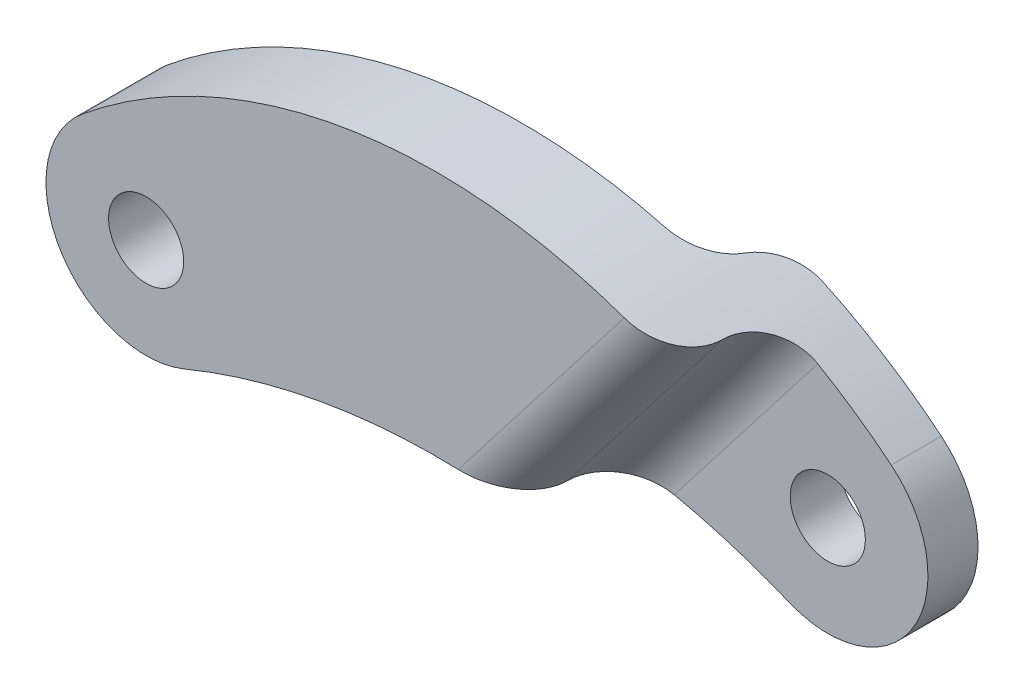
ISO-10303-21;
HEADER;
FILE_DESCRIPTION(('STEP AP214'),'2;1');
FILE_NAME('part.step','',(''),(''),'','','');
FILE_SCHEMA(('AUTOMOTIVE_DESIGN { 1 0 10303 214 1 1 1 1 }'));
ENDSEC;
DATA;
#1=APPLICATION_CONTEXT('core data for automotive mechanical design processes');
#2=APPLICATION_PROTOCOL_DEFINITION('international standard','automotive_design',2000,#1);
#3=PRODUCT_CONTEXT('',#1,'mechanical');
#4=PRODUCT('Part','Part','',(#3));
#5=PRODUCT_RELATED_PRODUCT_CATEGORY('part','',(#4));
#6=PRODUCT_DEFINITION_FORMATION('','',#4);
#7=PRODUCT_DEFINITION_CONTEXT('part definition',#1,'design');
#8=PRODUCT_DEFINITION('design','',#6,#7);
#9=PRODUCT_DEFINITION_SHAPE('','',#8);
#10=(LENGTH_UNIT() NAMED_UNIT(*) SI_UNIT(.MILLI.,.METRE.));
#11=(NAMED_UNIT(*) PLANE_ANGLE_UNIT() SI_UNIT($,.RADIAN.));
#12=(NAMED_UNIT(*) SI_UNIT($,.STERADIAN.) SOLID_ANGLE_UNIT());
#13=UNCERTAINTY_MEASURE_WITH_UNIT(LENGTH_MEASURE(1.E-05),#10,'distance_accuracy_value','');
#14=(GEOMETRIC_REPRESENTATION_CONTEXT(3) GLOBAL_UNCERTAINTY_ASSIGNED_CONTEXT((#13)) GLOBAL_UNIT_ASSIGNED_CONTEXT((#10,
#11,#12)) REPRESENTATION_CONTEXT('',''));
#15=CARTESIAN_POINT('',(0.,0.,0.));
#16=DIRECTION('',(0.,0.,1.));
#17=DIRECTION('',(1.,0.,0.));
#18=AXIS2_PLACEMENT_3D('',#15,#16,#17);
#19=CARTESIAN_POINT('',(0.,0.,0.5));
#20=DIRECTION('',(0.,0.,1.));
#21=DIRECTION('',(1.,0.,0.));
#22=AXIS2_PLACEMENT_3D('',#19,#20,#21);
#23=PLANE('',#22);
#24=CARTESIAN_POINT('',(5.80500000000001,-7.08580023417827,0.5));
#25=DIRECTION('',(0.,0.,1.));
#26=DIRECTION('',(-1.,0.,0.));
#27=AXIS2_PLACEMENT_3D('',#24,#25,#26);
#28=CIRCLE('',#27,11.1600540368865);
#29=CARTESIAN_POINT('',(12.8774597718799,1.54710882832013,0.5));
#30=VERTEX_POINT('',#29);
#31=CARTESIAN_POINT('',(11.409561525458,2.56488348323696,0.5));
#32=VERTEX_POINT('',#31);
#33=EDGE_CURVE('E142',#30,#32,#28,.T.);
#34=ORIENTED_EDGE('',*,*,#33,.T.);
#35=DIRECTION('',(0.612486689037816,0.790480901572893,0.));
#36=VECTOR('',#35,1.);
#37=CARTESIAN_POINT('',(5.88756775120085,-4.56185199571997,0.5));
#38=LINE('',#37,#36);
#39=CARTESIAN_POINT('',(8.54411179028973,-1.13329205364845,0.5));
#40=VERTEX_POINT('',#39);
#41=EDGE_CURVE('E58',#32,#40,#38,.F.);
#42=ORIENTED_EDGE('',*,*,#41,.T.);
#43=CARTESIAN_POINT('',(5.805,-14.0139650238523,0.5));
#44=DIRECTION('',(0.,0.,1.));
#45=DIRECTION('',(-1.,0.,0.));
#46=AXIS2_PLACEMENT_3D('',#43,#44,#45);
#47=CIRCLE('',#46,13.1686927811778);
#48=CARTESIAN_POINT('',(10.8446077432324,-1.8477485470919,0.5));
#49=VERTEX_POINT('',#48);
#50=EDGE_CURVE('E246',#49,#40,#47,.T.);
#51=ORIENTED_EDGE('',*,*,#50,.F.);
#52=CARTESIAN_POINT('',(11.61,0.,0.5));
#53=DIRECTION('',(0.,0.,1.));
#54=DIRECTION('',(1.,0.,0.));
#55=AXIS2_PLACEMENT_3D('',#52,#53,#54);
#56=CIRCLE('',#55,2.);
#57=EDGE_CURVE('E152',#49,#30,#56,.T.);
#58=ORIENTED_EDGE('',*,*,#57,.T.);
#59=EDGE_LOOP('',(#34,#42,#51,#58));
#60=FACE_BOUND('',#59,.T.);
#61=CARTESIAN_POINT('',(11.61,0.,0.5));
#62=DIRECTION('',(0.,0.,1.));
#63=DIRECTION('',(1.,0.,0.));
#64=AXIS2_PLACEMENT_3D('',#61,#62,#63);
#65=CIRCLE('',#64,0.750000000000002);
#66=CARTESIAN_POINT('',(12.36,0.,0.5));
#67=VERTEX_POINT('',#66);
#68=EDGE_CURVE('E146',#67,#67,#65,.T.);
#69=ORIENTED_EDGE('',*,*,#68,.F.);
#70=EDGE_LOOP('',(#69));
#71=FACE_BOUND('',#70,.T.);
#72=ADVANCED_FACE('F32',(#60,#71),#23,.T.);
#73=CARTESIAN_POINT('',(0.,0.,-0.5));
#74=DIRECTION('',(0.,0.,1.));
#75=DIRECTION('',(1.,0.,0.));
#76=AXIS2_PLACEMENT_3D('',#73,#74,#75);
#77=PLANE('',#76);
#78=CARTESIAN_POINT('',(5.805,-14.0139650238523,-0.5));
#79=DIRECTION('',(0.,0.,1.));
#80=DIRECTION('',(-1.,0.,0.));
#81=AXIS2_PLACEMENT_3D('',#78,#79,#80);
#82=CIRCLE('',#81,13.1686927811778);
#83=CARTESIAN_POINT('',(10.8446077432324,-1.8477485470919,-0.5));
#84=VERTEX_POINT('',#83);
#85=CARTESIAN_POINT('',(7.42474680096433,-0.945266164906543,-0.5));
#86=VERTEX_POINT('',#85);
#87=EDGE_CURVE('E235',#84,#86,#82,.T.);
#88=ORIENTED_EDGE('',*,*,#87,.T.);
#89=DIRECTION('',(0.612486689037816,0.790480901572893,0.));
#90=VECTOR('',#89,1.);
#91=CARTESIAN_POINT('',(5.09708684962795,-3.94936530668216,-0.5));
#92=LINE('',#91,#90);
#93=CARTESIAN_POINT('',(10.5085085495051,3.03466484559743,-0.5));
#94=VERTEX_POINT('',#93);
#95=EDGE_CURVE('E155',#86,#94,#92,.T.);
#96=ORIENTED_EDGE('',*,*,#95,.T.);
#97=CARTESIAN_POINT('',(5.80500000000001,-7.08580023417827,-0.5));
#98=DIRECTION('',(0.,0.,1.));
#99=DIRECTION('',(-1.,0.,0.));
#100=AXIS2_PLACEMENT_3D('',#97,#98,#99);
#101=CIRCLE('',#100,11.1600540368865);
#102=CARTESIAN_POINT('',(12.8774597718799,1.54710882832013,-0.5));
#103=VERTEX_POINT('',#102);
#104=EDGE_CURVE('E137',#103,#94,#101,.T.);
#105=ORIENTED_EDGE('',*,*,#104,.F.);
#106=CARTESIAN_POINT('',(11.61,0.,-0.5));
#107=DIRECTION('',(0.,0.,1.));
#108=DIRECTION('',(1.,0.,0.));
#109=AXIS2_PLACEMENT_3D('',#106,#107,#108);
#110=CIRCLE('',#109,2.);
#111=EDGE_CURVE('E149',#84,#103,#110,.T.);
#112=ORIENTED_EDGE('',*,*,#111,.F.);
#113=EDGE_LOOP('',(#88,#96,#105,#112));
#114=FACE_BOUND('',#113,.T.);
#115=CARTESIAN_POINT('',(11.61,0.,-0.5));
#116=DIRECTION('',(0.,0.,1.));
#117=DIRECTION('',(1.,0.,0.));
#118=AXIS2_PLACEMENT_3D('',#115,#116,#117);
#119=CIRCLE('',#118,0.750000000000002);
#120=CARTESIAN_POINT('',(12.36,0.,-0.5));
#121=VERTEX_POINT('',#120);
#122=EDGE_CURVE('E140',#121,#121,#119,.T.);
#123=ORIENTED_EDGE('',*,*,#122,.T.);
#124=EDGE_LOOP('',(#123));
#125=FACE_BOUND('',#124,.T.);
#126=ADVANCED_FACE('F241',(#114,#125),#77,.F.);
#127=CARTESIAN_POINT('',(0.,0.,0.5));
#128=DIRECTION('',(0.,0.,-1.));
#129=DIRECTION('',(-1.,0.,0.));
#130=AXIS2_PLACEMENT_3D('',#127,#128,#129);
#131=CYLINDRICAL_SURFACE('',#130,2.);
#132=DIRECTION('',(0.,0.,1.));
#133=VECTOR('',#132,1.);
#134=CARTESIAN_POINT('',(-1.26745977187993,1.54710882832013,-0.5));
#135=LINE('',#134,#133);
#136=CARTESIAN_POINT('',(-1.26745977187993,1.54710882832013,0.8));
#137=VERTEX_POINT('',#136);
#138=CARTESIAN_POINT('',(-1.26745977187993,1.54710882832013,2.5));
#139=VERTEX_POINT('',#138);
#140=EDGE_CURVE('E118',#137,#139,#135,.T.);
#141=ORIENTED_EDGE('',*,*,#140,.F.);
#142=CARTESIAN_POINT('',(0.,0.,0.8));
#143=DIRECTION('',(0.,0.,1.));
#144=DIRECTION('',(1.,0.,0.));
#145=AXIS2_PLACEMENT_3D('',#142,#143,#144);
#146=CIRCLE('',#145,2.);
#147=CARTESIAN_POINT('',(0.765392256767593,-1.8477485470919,0.8));
#148=VERTEX_POINT('',#147);
#149=EDGE_CURVE('E124',#137,#148,#146,.T.);
#150=ORIENTED_EDGE('',*,*,#149,.T.);
#151=DIRECTION('',(0.,0.,1.));
#152=VECTOR('',#151,1.);
#153=CARTESIAN_POINT('',(0.765392256767595,-1.8477485470919,-0.5));
#154=LINE('',#153,#152);
#155=CARTESIAN_POINT('',(0.765392256767593,-1.8477485470919,2.5));
#156=VERTEX_POINT('',#155);
#157=EDGE_CURVE('E250',#148,#156,#154,.T.);
#158=ORIENTED_EDGE('',*,*,#157,.T.);
#159=CARTESIAN_POINT('',(0.,0.,2.5));
#160=DIRECTION('',(0.,0.,1.));
#161=DIRECTION('',(1.,0.,0.));
#162=AXIS2_PLACEMENT_3D('',#159,#160,#161);
#163=CIRCLE('',#162,2.);
#164=EDGE_CURVE('E135',#139,#156,#163,.T.);
#165=ORIENTED_EDGE('',*,*,#164,.F.);
#166=EDGE_LOOP('',(#141,#150,#158,#165));
#167=FACE_BOUND('',#166,.T.);
#168=ADVANCED_FACE('F133',(#167),#131,.T.);
#169=CARTESIAN_POINT('',(11.61,0.,0.5));
#170=DIRECTION('',(0.,0.,-1.));
#171=DIRECTION('',(-1.,0.,0.));
#172=AXIS2_PLACEMENT_3D('',#169,#170,#171);
#173=CYLINDRICAL_SURFACE('',#172,2.);
#174=ORIENTED_EDGE('',*,*,#111,.T.);
#175=DIRECTION('',(0.,0.,1.));
#176=VECTOR('',#175,1.);
#177=CARTESIAN_POINT('',(12.8774597718799,1.54710882832013,-0.5));
#178=LINE('',#177,#176);
#179=EDGE_CURVE('E136',#103,#30,#178,.T.);
#180=ORIENTED_EDGE('',*,*,#179,.T.);
#181=ORIENTED_EDGE('',*,*,#57,.F.);
#182=DIRECTION('',(0.,0.,1.));
#183=VECTOR('',#182,1.);
#184=CARTESIAN_POINT('',(10.8446077432324,-1.8477485470919,-0.5));
#185=LINE('',#184,#183);
#186=EDGE_CURVE('E245',#84,#49,#185,.T.);
#187=ORIENTED_EDGE('',*,*,#186,.F.);
#188=EDGE_LOOP('',(#174,#180,#181,#187));
#189=FACE_BOUND('',#188,.T.);
#190=ADVANCED_FACE('F249',(#189),#173,.T.);
#191=CARTESIAN_POINT('',(0.,0.,0.5));
#192=DIRECTION('',(0.,0.,-1.));
#193=DIRECTION('',(-1.,0.,0.));
#194=AXIS2_PLACEMENT_3D('',#191,#192,#193);
#195=CYLINDRICAL_SURFACE('',#194,0.75);
#196=CARTESIAN_POINT('',(0.,0.,0.8));
#197=DIRECTION('',(0.,0.,1.));
#198=DIRECTION('',(1.,0.,0.));
#199=AXIS2_PLACEMENT_3D('',#196,#197,#198);
#200=CIRCLE('',#199,0.75);
#201=CARTESIAN_POINT('',(0.75,0.,0.8));
#202=VERTEX_POINT('',#201);
#203=EDGE_CURVE('E266',#202,#202,#200,.T.);
#204=ORIENTED_EDGE('',*,*,#203,.F.);
#205=EDGE_LOOP('',(#204));
#206=FACE_BOUND('',#205,.T.);
#207=CARTESIAN_POINT('',(0.,0.,2.5));
#208=DIRECTION('',(0.,0.,1.));
#209=DIRECTION('',(1.,0.,0.));
#210=AXIS2_PLACEMENT_3D('',#207,#208,#209);
#211=CIRCLE('',#210,0.75);
#212=CARTESIAN_POINT('',(0.75,0.,2.5));
#213=VERTEX_POINT('',#212);
#214=EDGE_CURVE('E261',#213,#213,#211,.T.);
#215=ORIENTED_EDGE('',*,*,#214,.T.);
#216=EDGE_LOOP('',(#215));
#217=FACE_BOUND('',#216,.T.);
#218=ADVANCED_FACE('F284',(#206,#217),#195,.F.);
#219=CARTESIAN_POINT('',(11.61,0.,0.5));
#220=DIRECTION('',(0.,0.,-1.));
#221=DIRECTION('',(-1.,0.,0.));
#222=AXIS2_PLACEMENT_3D('',#219,#220,#221);
#223=CYLINDRICAL_SURFACE('',#222,0.750000000000002);
#224=ORIENTED_EDGE('',*,*,#68,.T.);
#225=EDGE_LOOP('',(#224));
#226=FACE_BOUND('',#225,.T.);
#227=ORIENTED_EDGE('',*,*,#122,.F.);
#228=EDGE_LOOP('',(#227));
#229=FACE_BOUND('',#228,.T.);
#230=ADVANCED_FACE('F303',(#226,#229),#223,.F.);
#231=CARTESIAN_POINT('',(5.80500000000001,-7.08580023417827,-0.5));
#232=DIRECTION('',(0.,0.,1.));
#233=DIRECTION('',(1.,0.,0.));
#234=AXIS2_PLACEMENT_3D('',#231,#232,#233);
#235=CYLINDRICAL_SURFACE('',#234,11.1600540368865);
#236=ORIENTED_EDGE('',*,*,#104,.T.);
#237=CARTESIAN_POINT('',(10.5085085495051,3.03466484559743,-0.5));
#238=CARTESIAN_POINT('',(10.4545997913314,3.05973895002356,-0.500038307200525));
#239=CARTESIAN_POINT('',(10.4004991351627,3.08433910603536,-0.494961999885077));
#240=CARTESIAN_POINT('',(10.2934827304667,3.13201024938711,-0.474986815324863));
#241=CARTESIAN_POINT('',(10.2405663411904,3.15508207755746,-0.460093389332842));
#242=CARTESIAN_POINT('',(10.1374120896524,3.19914943907394,-0.420885271336029));
#243=CARTESIAN_POINT('',(10.0871748457609,3.22014449403035,-0.396568414935799));
#244=CARTESIAN_POINT('',(9.99090245106407,3.25962039999629,-0.33916165681637));
#245=CARTESIAN_POINT('',(9.94486686555581,3.27810151119532,-0.306072664047405));
#246=CARTESIAN_POINT('',(9.85852226097701,3.31217652495307,-0.231988760963064));
#247=CARTESIAN_POINT('',(9.81820664943204,3.3277737576782,-0.191003082518444));
#248=CARTESIAN_POINT('',(9.74466284481199,3.35581916156376,-0.102143245266141));
#249=CARTESIAN_POINT('',(9.71143499904493,3.36826717841484,-0.0542687490914888));
#250=CARTESIAN_POINT('',(9.65429153012761,3.38944029916484,0.0454597621794512));
#251=CARTESIAN_POINT('',(9.63012023971885,3.39826841148349,0.0971454374043927));
#252=CARTESIAN_POINT('',(9.59071155312003,3.41256338698437,0.204223596234319));
#253=CARTESIAN_POINT('',(9.57546274942595,3.41803454251251,0.259611245370437));
#254=CARTESIAN_POINT('',(9.55938610441248,3.42378701122959,0.346264680392394));
#255=CARTESIAN_POINT('',(9.5551505994438,3.42529822380831,0.376857090287763));
#256=CARTESIAN_POINT('',(9.54949872009529,3.4273124958907,0.438294114106932));
#257=CARTESIAN_POINT('',(9.54807871887972,3.4278168523977,0.469138352108181));
#258=CARTESIAN_POINT('',(9.54808119356653,3.42781709215597,0.5));
#259=B_SPLINE_CURVE_WITH_KNOTS('',3,(#237,#238,#239,#240,#241,#242,#243,#244,#245,#246,#247,
#248,#249,#250,#251,#252,#253,#254,#255,#256,#257,#258),.UNSPECIFIED.,.F.,.F.,(4,2,2,2,2,2,2,2,
2,2,4),(0.,0.178110237207162,0.356121656526966,0.534173986179928,0.712207873632867,
0.890034874192797,1.06787058646342,1.24021984957285,1.41234827791813,1.50498191224225,
1.59749614135646),.UNSPECIFIED.);
#260=CARTESIAN_POINT('',(9.61066818006019,3.40532438663833,0.150000000000001));
#261=VERTEX_POINT('',#260);
#262=EDGE_CURVE('E167',#94,#261,#259,.T.);
#263=ORIENTED_EDGE('',*,*,#262,.T.);
#264=CARTESIAN_POINT('',(9.61066818006019,3.40532438663833,0.15));
#265=CARTESIAN_POINT('',(9.60104391336495,3.40881513212217,0.176085519654819));
#266=CARTESIAN_POINT('',(9.59035270948725,3.41267886889881,0.201711384994293));
#267=CARTESIAN_POINT('',(9.56692228490636,3.42109770255776,0.251883180060699));
#268=CARTESIAN_POINT('',(9.55418357356539,3.4256526274762,0.276429376449546));
#269=CARTESIAN_POINT('',(9.51311083071071,3.4402418270236,0.348062977268186));
#270=CARTESIAN_POINT('',(9.48185314641106,3.45122516300105,0.393325980241011));
#271=CARTESIAN_POINT('',(9.4125827096049,3.47514153822328,0.477657776101736));
#272=CARTESIAN_POINT('',(9.37457331896887,3.4880736066538,0.516729633505074));
#273=CARTESIAN_POINT('',(9.29289466341916,3.51529629407549,0.587873425484103));
#274=CARTESIAN_POINT('',(9.24922349954141,3.529587368448,0.619943001757442));
#275=CARTESIAN_POINT('',(9.15586292799793,3.55943368433884,0.677444969317043));
#276=CARTESIAN_POINT('',(9.1060176386546,3.57501555106899,0.702609523057617));
#277=CARTESIAN_POINT('',(9.00292882872925,3.60639124509719,0.744433990444252));
#278=CARTESIAN_POINT('',(8.94968442431669,3.6221851266729,0.761091681938328));
#279=CARTESIAN_POINT('',(8.85635965322597,3.64908058369192,0.782322576424806));
#280=CARTESIAN_POINT('',(8.81675765428668,3.66026027275357,0.788971798337664));
#281=CARTESIAN_POINT('',(8.73707083994223,3.68227710299579,0.797806425010267));
#282=CARTESIAN_POINT('',(8.69698747212269,3.69311502773634,0.800002902382102));
#283=CARTESIAN_POINT('',(8.65683845296873,3.70372355255096,0.8));
#284=B_SPLINE_CURVE_WITH_KNOTS('',3,(#264,#265,#266,#267,#268,#269,#270,#271,#272,#273,#274,
#275,#276,#277,#278,#279,#280,#281,#282,#283),.UNSPECIFIED.,.F.,.F.,(4,2,2,2,2,2,2,2,2,4),(0.,
0.084012468830498,0.168004069980026,0.335412368609916,0.502737542267542,0.670118982841301,
0.843288013287649,1.01650225562468,1.14132138333945,1.26582974147891),.UNSPECIFIED.);
#285=CARTESIAN_POINT('',(8.65683845296873,3.70372355255096,0.8));
#286=VERTEX_POINT('',#285);
#287=EDGE_CURVE('E121',#261,#286,#284,.T.);
#288=ORIENTED_EDGE('',*,*,#287,.T.);
#289=CARTESIAN_POINT('',(5.80500000000001,-7.08580023417827,0.8));
#290=DIRECTION('',(0.,0.,1.));
#291=DIRECTION('',(1.,0.,0.));
#292=AXIS2_PLACEMENT_3D('',#289,#290,#291);
#293=CIRCLE('',#292,11.1600540368865);
#294=EDGE_CURVE('E112',#286,#137,#293,.T.);
#295=ORIENTED_EDGE('',*,*,#294,.T.);
#296=ORIENTED_EDGE('',*,*,#140,.T.);
#297=CARTESIAN_POINT('',(5.80500000000001,-7.08580023417827,2.5));
#298=DIRECTION('',(0.,0.,1.));
#299=DIRECTION('',(1.,0.,0.));
#300=AXIS2_PLACEMENT_3D('',#297,#298,#299);
#301=CIRCLE('',#300,11.1600540368865);
#302=CARTESIAN_POINT('',(9.54808119356654,3.42781709215597,2.5));
#303=VERTEX_POINT('',#302);
#304=EDGE_CURVE('E260',#303,#139,#301,.T.);
#305=ORIENTED_EDGE('',*,*,#304,.F.);
#306=CARTESIAN_POINT('',(9.54808119356654,3.42781709215597,2.5));
#307=CARTESIAN_POINT('',(9.60479113928533,3.40764729536137,2.50004466491557));
#308=CARTESIAN_POINT('',(9.66134807675275,3.38697524235907,2.49509619546598));
#309=CARTESIAN_POINT('',(9.7726530375485,3.34530504808339,2.47534028925758));
#310=CARTESIAN_POINT('',(9.82739914336134,3.3243065937048,2.46052273200392));
#311=CARTESIAN_POINT('',(9.93353735035689,3.28267467020534,2.4211264560919));
#312=CARTESIAN_POINT('',(9.9849242198029,3.26204180524963,2.39653291493059));
#313=CARTESIAN_POINT('',(10.082654603678,3.22202486408923,2.33812752979995));
#314=CARTESIAN_POINT('',(10.1290022964875,3.20263975879507,2.3043234058774));
#315=CARTESIAN_POINT('',(10.2138251008774,3.16657163373209,2.22959565288845));
#316=CARTESIAN_POINT('',(10.2525076857137,3.14982110291029,2.18894020604948));
#317=CARTESIAN_POINT('',(10.3226578803333,3.11905373631276,2.10089282178147));
#318=CARTESIAN_POINT('',(10.3541241778452,3.10503739781499,2.05349966164348));
#319=CARTESIAN_POINT('',(10.4079111552897,3.08085398540459,1.95511546541881));
#320=CARTESIAN_POINT('',(10.430508724499,3.07057128319713,1.90430380427422));
#321=CARTESIAN_POINT('',(10.4673865561996,3.05369545668609,1.79919538324296));
#322=CARTESIAN_POINT('',(10.4816749731903,3.04709871527602,1.74490209849027));
#323=CARTESIAN_POINT('',(10.4972319321875,3.03989982669158,1.65846142834048));
#324=CARTESIAN_POINT('',(10.5014596976246,3.03793860201241,1.62692543100499));
#325=CARTESIAN_POINT('',(10.5070963360006,3.0353212397165,1.56359799644812));
#326=CARTESIAN_POINT('',(10.5085095460513,3.03466309411866,1.53180702815453));
#327=CARTESIAN_POINT('',(10.5085085495051,3.03466484559743,1.5));
#328=B_SPLINE_CURVE_WITH_KNOTS('',3,(#306,#307,#308,#309,#310,#311,#312,#313,#314,#315,#316,
#317,#318,#319,#320,#321,#322,#323,#324,#325,#326,#327),.UNSPECIFIED.,.F.,.F.,(4,2,2,2,2,2,2,2,
2,2,4),(0.,0.180402825065742,0.360990933993724,0.541853904341653,0.722565744398397,
0.897383264136049,1.07223254901905,1.24107913791347,1.40975974198445,1.50525834491122,
1.60060967427656),.UNSPECIFIED.);
#329=CARTESIAN_POINT('',(10.5085085495051,3.03466484559743,1.5));
#330=VERTEX_POINT('',#329);
#331=EDGE_CURVE('E160',#303,#330,#328,.T.);
#332=ORIENTED_EDGE('',*,*,#331,.T.);
#333=CARTESIAN_POINT('',(10.5085085495051,3.03466484559743,1.5));
#334=CARTESIAN_POINT('',(10.5085079821643,3.03466443992367,1.47231611605151));
#335=CARTESIAN_POINT('',(10.509578539391,3.0341676381714,1.44464574662319));
#336=CARTESIAN_POINT('',(10.5138445706943,3.03218361238759,1.3895082622763));
#337=CARTESIAN_POINT('',(10.5170397974425,3.03069650363563,1.36204112407624));
#338=CARTESIAN_POINT('',(10.5297657242431,3.02476295467184,1.28033488413742));
#339=CARTESIAN_POINT('',(10.5424368653114,3.01884425450083,1.22665150853327));
#340=CARTESIAN_POINT('',(10.5756898838789,3.00318670254221,1.12240899322599));
#341=CARTESIAN_POINT('',(10.5962729563652,2.99344727368213,1.07185032680633));
#342=CARTESIAN_POINT('',(10.6446233606778,2.97032065843732,0.975193292122565));
#343=CARTESIAN_POINT('',(10.6723913485879,2.95693313892467,0.929095331712096));
#344=CARTESIAN_POINT('',(10.7345968263325,2.92654672762075,0.841995767513028));
#345=CARTESIAN_POINT('',(10.7691175658354,2.90950247062166,0.801069521491699));
#346=CARTESIAN_POINT('',(10.8434925496988,2.8722179701158,0.72608035945098));
#347=CARTESIAN_POINT('',(10.8833482000331,2.85197688385599,0.692019258636275));
#348=CARTESIAN_POINT('',(10.9680629441004,2.80823353494426,0.631009018741774));
#349=CARTESIAN_POINT('',(11.013009337538,2.78467185600187,0.604223748718969));
#350=CARTESIAN_POINT('',(11.1058430609583,2.73512797388139,0.559465265795672));
#351=CARTESIAN_POINT('',(11.1537288651537,2.70914702293657,0.54148752389495));
#352=CARTESIAN_POINT('',(11.2364880243384,2.66341844787549,0.518827086077654));
#353=CARTESIAN_POINT('',(11.2709822205243,2.64412313661005,0.511778229823213));
#354=CARTESIAN_POINT('',(11.3402033737145,2.60491335431612,0.502364024312786));
#355=CARTESIAN_POINT('',(11.374930020999,2.58499961323456,0.49999335185671));
#356=CARTESIAN_POINT('',(11.409561525458,2.56488348323696,0.5));
#357=B_SPLINE_CURVE_WITH_KNOTS('',3,(#333,#334,#335,#336,#337,#338,#339,#340,#341,#342,#343,
#344,#345,#346,#347,#348,#349,#350,#351,#352,#353,#354,#355,#356),.UNSPECIFIED.,.F.,.F.,(4,2,2,
2,2,2,2,2,2,2,2,4),(0.,0.0829998028282258,0.165989945510503,0.331557292873975,0.497149656712741,
0.662757146802546,0.830552065641355,0.998391292895606,1.16974525724486,1.34101101536481,
1.46119089358887,1.58123394279946),.UNSPECIFIED.);
#358=EDGE_CURVE('E45',#330,#32,#357,.T.);
#359=ORIENTED_EDGE('',*,*,#358,.T.);
#360=ORIENTED_EDGE('',*,*,#33,.F.);
#361=ORIENTED_EDGE('',*,*,#179,.F.);
#362=EDGE_LOOP('',(#236,#263,#288,#295,#296,#305,#332,#359,#360,#361));
#363=FACE_BOUND('',#362,.T.);
#364=ADVANCED_FACE('F115',(#363),#235,.T.);
#365=CARTESIAN_POINT('',(5.805,-14.0139650238523,-0.5));
#366=DIRECTION('',(0.,0.,1.));
#367=DIRECTION('',(1.,0.,0.));
#368=AXIS2_PLACEMENT_3D('',#365,#366,#367);
#369=CYLINDRICAL_SURFACE('',#368,13.1686927811778);
#370=CARTESIAN_POINT('',(5.805,-14.0139650238523,0.8));
#371=DIRECTION('',(0.,0.,-1.));
#372=DIRECTION('',(1.,0.,0.));
#373=AXIS2_PLACEMENT_3D('',#370,#371,#372);
#374=CIRCLE('',#373,13.1686927811778);
#375=CARTESIAN_POINT('',(5.11826569497717,-0.863190690781676,0.8));
#376=VERTEX_POINT('',#375);
#377=EDGE_CURVE('E129',#148,#376,#374,.T.);
#378=ORIENTED_EDGE('',*,*,#377,.T.);
#379=CARTESIAN_POINT('',(5.11826569497717,-0.863190690781675,0.8));
#380=CARTESIAN_POINT('',(5.20238558463027,-0.858764379613389,0.799978600577034));
#381=CARTESIAN_POINT('',(5.28678321401811,-0.855198922607742,0.793883882306117));
#382=CARTESIAN_POINT('',(5.45424425878165,-0.849684912269832,0.768586981098798));
#383=CARTESIAN_POINT('',(5.53729345530309,-0.847748340331775,0.749289532109288));
#384=CARTESIAN_POINT('',(5.6851020200592,-0.845645314134488,0.701089415848795));
#385=CARTESIAN_POINT('',(5.75056660901381,-0.845233469502223,0.674383698582748));
#386=CARTESIAN_POINT('',(5.87627450537823,-0.845316397214608,0.610824542320302));
#387=CARTESIAN_POINT('',(5.93653059276946,-0.845808880457441,0.573996925230744));
#388=CARTESIAN_POINT('',(6.03909415411996,-0.847271703873509,0.49771369078575));
#389=CARTESIAN_POINT('',(6.08267054453996,-0.848138464733629,0.459963482905231));
#390=CARTESIAN_POINT('',(6.16300065683459,-0.850078320888575,0.377840818718229));
#391=CARTESIAN_POINT('',(6.19976997654584,-0.851150932701799,0.333483933107323));
#392=CARTESIAN_POINT('',(6.24702990971045,-0.852684644722005,0.264664898481728));
#393=CARTESIAN_POINT('',(6.26093719822099,-0.853161080913181,0.242501801334194));
#394=CARTESIAN_POINT('',(6.28681006595921,-0.854083026958141,0.197060560697911));
#395=CARTESIAN_POINT('',(6.29877498544662,-0.854528526274704,0.173782041810381));
#396=CARTESIAN_POINT('',(6.30969091334131,-0.854946950795518,0.150000000000006));
#397=B_SPLINE_CURVE_WITH_KNOTS('',3,(#379,#380,#381,#382,#383,#384,#385,#386,#387,#388,#389,
#390,#391,#392,#393,#394,#395,#396),.UNSPECIFIED.,.F.,.F.,(4,2,2,2,2,2,2,2,4),(0.,
0.252866375070483,0.50757685563321,0.718886291703554,0.929661582814908,1.10198075129757,
1.27390004063179,1.35232561419748,1.43077777011687),.UNSPECIFIED.);
#398=CARTESIAN_POINT('',(6.30969091334127,-0.854946950795509,0.149999999999983));
#399=VERTEX_POINT('',#398);
#400=EDGE_CURVE('E206',#376,#399,#397,.T.);
#401=ORIENTED_EDGE('',*,*,#400,.T.);
#402=CARTESIAN_POINT('',(6.23181151562507,-0.852190770539255,0.5));
#403=CARTESIAN_POINT('',(6.23180845685173,-0.852191139241992,0.47549327650389));
#404=CARTESIAN_POINT('',(6.23292414107021,-0.85222680896996,0.451000265046908));
#405=CARTESIAN_POINT('',(6.23735328853625,-0.852371363605529,0.402226602135865));
#406=CARTESIAN_POINT('',(6.24066559867248,-0.852480210099648,0.377945846031133));
#407=CARTESIAN_POINT('',(6.25377956222271,-0.8529184727158,0.305990686468831));
#408=CARTESIAN_POINT('',(6.26675948069307,-0.853359552091774,0.258862979945064));
#409=CARTESIAN_POINT('',(6.30037592740979,-0.854582461997866,0.167582932130136));
#410=CARTESIAN_POINT('',(6.32099926779056,-0.855363706015664,0.12342561990423));
#411=CARTESIAN_POINT('',(6.3688519900811,-0.857327418155974,0.0388104738141371));
#412=CARTESIAN_POINT('',(6.3960905287614,-0.858510443337013,-0.00164212415932972));
#413=CARTESIAN_POINT('',(6.45831080829641,-0.861448411997837,-0.0811230408492553));
#414=CARTESIAN_POINT('',(6.49372293195729,-0.863239904316494,-0.119811075748784));
#415=CARTESIAN_POINT('',(6.56958606050184,-0.86743227802134,-0.191803098287842));
#416=CARTESIAN_POINT('',(6.61003821597006,-0.869833298686511,-0.225105852524277));
#417=CARTESIAN_POINT('',(6.70263701604407,-0.87580551439101,-0.291724667818891));
#418=CARTESIAN_POINT('',(6.75557088293445,-0.879510269683333,-0.323935105994872));
#419=CARTESIAN_POINT('',(6.86546508774972,-0.887924492729358,-0.380443053218253));
#420=CARTESIAN_POINT('',(6.92243018272212,-0.892635161188027,-0.404731017279623));
#421=CARTESIAN_POINT('',(7.05215416235254,-0.904268037398537,-0.449783070690396));
#422=CARTESIAN_POINT('',(7.12559320712157,-0.911449260857848,-0.468540075197545));
#423=CARTESIAN_POINT('',(7.27430827226854,-0.927278288118814,-0.493636073806774));
#424=CARTESIAN_POINT('',(7.3495817232013,-0.935924131325889,-0.499991528537834));
#425=CARTESIAN_POINT('',(7.42474680096433,-0.945266164906542,-0.5));
#426=B_SPLINE_CURVE_WITH_KNOTS('',3,(#402,#403,#404,#405,#406,#407,#408,#409,#410,#411,#412,
#413,#414,#415,#416,#417,#418,#419,#420,#421,#422,#423,#424,#425),.UNSPECIFIED.,.F.,.F.,(4,2,2,
2,2,2,2,2,2,2,2,4),(0.,0.0734684490759452,0.146898361634635,0.292751689510141,0.438354526604062,
0.584160067790014,0.741015688946585,0.897907184376364,1.08341666342107,1.26914882553572,
1.49647292242717,1.72349508530127),.UNSPECIFIED.);
#427=EDGE_CURVE('E190',#399,#86,#426,.T.);
#428=ORIENTED_EDGE('',*,*,#427,.T.);
#429=ORIENTED_EDGE('',*,*,#87,.F.);
#430=ORIENTED_EDGE('',*,*,#186,.T.);
#431=ORIENTED_EDGE('',*,*,#50,.T.);
#432=CARTESIAN_POINT('',(8.54411179028973,-1.13329205364845,0.5));
#433=CARTESIAN_POINT('',(8.47620645867082,-1.11883042336752,0.499991154604004));
#434=CARTESIAN_POINT('',(8.40819210493737,-1.10494910049924,0.505864592847744));
#435=CARTESIAN_POINT('',(8.273730489546,-1.07857190118771,0.529045048238693));
#436=CARTESIAN_POINT('',(8.20728631081606,-1.0660785966128,0.546372889815682));
#437=CARTESIAN_POINT('',(8.07797175088626,-1.04274960768125,0.59214280443788));
#438=CARTESIAN_POINT('',(8.01510360419864,-1.03191495274738,0.620591741064491));
#439=CARTESIAN_POINT('',(7.89507451139023,-1.01205183979277,0.688169427405429));
#440=CARTESIAN_POINT('',(7.83791071776311,-1.00302247832128,0.727292811843936));
#441=CARTESIAN_POINT('',(7.73368656140914,-0.987172855159449,0.81388034261669));
#442=CARTESIAN_POINT('',(7.68631856181271,-0.980280025767659,0.860958582686055));
#443=CARTESIAN_POINT('',(7.60137508682262,-0.96830095643697,0.963502861158073));
#444=CARTESIAN_POINT('',(7.5637931128776,-0.963213516784255,1.01896329436761));
#445=CARTESIAN_POINT('',(7.50485278017103,-0.95541434126254,1.1292323721004));
#446=CARTESIAN_POINT('',(7.48205360562619,-0.952485120371871,1.18325576179941));
#447=CARTESIAN_POINT('',(7.44738159915649,-0.948079424381282,1.29469045851749));
#448=CARTESIAN_POINT('',(7.43547590737595,-0.946598579361933,1.35209101712759));
#449=CARTESIAN_POINT('',(7.42786880123096,-0.945653499235207,1.42495656790778));
#450=CARTESIAN_POINT('',(7.42669812362994,-0.945508173429303,1.43995090588103));
#451=CARTESIAN_POINT('',(7.42513844435503,-0.945314652297461,1.46996101233869));
#452=CARTESIAN_POINT('',(7.42474841411406,-0.945266329162281,1.48497672650312));
#453=CARTESIAN_POINT('',(7.42474680096433,-0.945266164906538,1.5));
#454=B_SPLINE_CURVE_WITH_KNOTS('',3,(#432,#433,#434,#435,#436,#437,#438,#439,#440,#441,#442,
#443,#444,#445,#446,#447,#448,#449,#450,#451,#452,#453),.UNSPECIFIED.,.F.,.F.,(4,2,2,2,2,2,2,2,
2,2,4),(0.,0.208022654760259,0.416424544568668,0.624955256884633,0.833381348311818,
1.03365852341593,1.23380236043066,1.40892580740925,1.58351924143488,1.62862831323804,
1.6736779109015),.UNSPECIFIED.);
#455=CARTESIAN_POINT('',(7.42474680096433,-0.945266164906542,1.5));
#456=VERTEX_POINT('',#455);
#457=EDGE_CURVE('E11',#40,#456,#454,.T.);
#458=ORIENTED_EDGE('',*,*,#457,.T.);
#459=CARTESIAN_POINT('',(7.42474680096433,-0.945266164906542,1.5));
#460=CARTESIAN_POINT('',(7.42474824378731,-0.945266805260724,1.5251876114769));
#461=CARTESIAN_POINT('',(7.42364760094938,-0.945129883128837,1.55036213796094));
#462=CARTESIAN_POINT('',(7.41926783501788,-0.944587983045424,1.60051057315308));
#463=CARTESIAN_POINT('',(7.41598936885114,-0.944183085927016,1.62548454006029));
#464=CARTESIAN_POINT('',(7.40296791242617,-0.942582209871265,1.69962114137935));
#465=CARTESIAN_POINT('',(7.39003827036568,-0.940999900524855,1.74825137526711));
#466=CARTESIAN_POINT('',(7.35628758605538,-0.936952357713761,1.84256346119557));
#467=CARTESIAN_POINT('',(7.33547223004426,-0.934487760520435,1.88824741003447));
#468=CARTESIAN_POINT('',(7.28682787878807,-0.928887515436232,1.97569551630254));
#469=CARTESIAN_POINT('',(7.25899338327209,-0.925751341582929,2.01745656431781));
#470=CARTESIAN_POINT('',(7.19590447943489,-0.918893270451528,2.09811120771486));
#471=CARTESIAN_POINT('',(7.16036195753881,-0.915150719694756,2.1367765580781));
#472=CARTESIAN_POINT('',(7.08397796696187,-0.907472013976818,2.20838893250842));
#473=CARTESIAN_POINT('',(7.04313619660805,-0.903535848001549,2.24133563077714));
#474=CARTESIAN_POINT('',(6.95171261162994,-0.895204278481867,2.30518013871335));
#475=CARTESIAN_POINT('',(6.90055499967352,-0.890815811476065,2.33525260871471));
#476=CARTESIAN_POINT('',(6.79437103325472,-0.882382057794862,2.38777365229687));
#477=CARTESIAN_POINT('',(6.73933781510464,-0.878337409466836,2.41020826750891));
#478=CARTESIAN_POINT('',(6.61040895197262,-0.869725814924579,2.45295236657057));
#479=CARTESIAN_POINT('',(6.53567152918667,-0.865347561763234,2.47075877370386));
#480=CARTESIAN_POINT('',(6.38450619811651,-0.857805138771778,2.49426593823586));
#481=CARTESIAN_POINT('',(6.30808516338805,-0.854636751207356,2.50000907078756));
#482=CARTESIAN_POINT('',(6.23181151562507,-0.852190770539256,2.5));
#483=B_SPLINE_CURVE_WITH_KNOTS('',3,(#459,#460,#461,#462,#463,#464,#465,#466,#467,#468,#469,
#470,#471,#472,#473,#474,#475,#476,#477,#478,#479,#480,#481,#482),.UNSPECIFIED.,.F.,.F.,(4,2,2,
2,2,2,2,2,2,2,2,4),(0.,0.075512914475057,0.151003061287907,0.301235016897313,0.451358848653137,
0.601600686560247,0.75893094537527,0.916270164541143,1.09409584748994,1.27224478836875,
1.50205736322303,1.73106130675919),.UNSPECIFIED.);
#484=CARTESIAN_POINT('',(6.23181151562507,-0.852190770539253,2.5));
#485=VERTEX_POINT('',#484);
#486=EDGE_CURVE('E185',#456,#485,#483,.T.);
#487=ORIENTED_EDGE('',*,*,#486,.T.);
#488=CARTESIAN_POINT('',(5.805,-14.0139650238523,2.5));
#489=DIRECTION('',(0.,0.,-1.));
#490=DIRECTION('',(1.,0.,0.));
#491=AXIS2_PLACEMENT_3D('',#488,#489,#490);
#492=CIRCLE('',#491,13.1686927811778);
#493=EDGE_CURVE('E263',#156,#485,#492,.T.);
#494=ORIENTED_EDGE('',*,*,#493,.F.);
#495=ORIENTED_EDGE('',*,*,#157,.F.);
#496=EDGE_LOOP('',(#378,#401,#428,#429,#430,#431,#458,#487,#494,#495));
#497=FACE_BOUND('',#496,.T.);
#498=ADVANCED_FACE('F195',(#497),#369,.F.);
#499=CARTESIAN_POINT('',(5.80500000000001,-7.08580023417827,2.5));
#500=DIRECTION('',(0.,0.,1.));
#501=DIRECTION('',(1.,0.,0.));
#502=AXIS2_PLACEMENT_3D('',#499,#500,#501);
#503=PLANE('',#502);
#504=ORIENTED_EDGE('',*,*,#493,.T.);
#505=DIRECTION('',(0.612486689037816,0.790480901572893,0.));
#506=VECTOR('',#505,1.);
#507=CARTESIAN_POINT('',(9.7180276479322,3.64715153463525,2.5));
#508=LINE('',#507,#506);
#509=EDGE_CURVE('E226',#485,#303,#508,.T.);
#510=ORIENTED_EDGE('',*,*,#509,.T.);
#511=ORIENTED_EDGE('',*,*,#304,.T.);
#512=ORIENTED_EDGE('',*,*,#164,.T.);
#513=EDGE_LOOP('',(#504,#510,#511,#512));
#514=FACE_BOUND('',#513,.T.);
#515=ORIENTED_EDGE('',*,*,#214,.F.);
#516=EDGE_LOOP('',(#515));
#517=FACE_BOUND('',#516,.T.);
#518=ADVANCED_FACE('F199',(#514,#517),#503,.T.);
#519=CARTESIAN_POINT('',(5.80500000000001,-7.08580023417827,0.8));
#520=DIRECTION('',(0.,0.,1.));
#521=DIRECTION('',(1.,0.,0.));
#522=AXIS2_PLACEMENT_3D('',#519,#520,#521);
#523=PLANE('',#522);
#524=ORIENTED_EDGE('',*,*,#203,.T.);
#525=EDGE_LOOP('',(#524));
#526=FACE_BOUND('',#525,.T.);
#527=ORIENTED_EDGE('',*,*,#294,.F.);
#528=DIRECTION('',(0.612486689037816,0.790480901572893,0.));
#529=VECTOR('',#528,1.);
#530=CARTESIAN_POINT('',(2.36315456233144,-4.41896222189628,0.8));
#531=LINE('',#530,#529);
#532=EDGE_CURVE('E219',#286,#376,#531,.F.);
#533=ORIENTED_EDGE('',*,*,#532,.T.);
#534=ORIENTED_EDGE('',*,*,#377,.F.);
#535=ORIENTED_EDGE('',*,*,#149,.F.);
#536=EDGE_LOOP('',(#527,#533,#534,#535));
#537=FACE_BOUND('',#536,.T.);
#538=ADVANCED_FACE('F127',(#526,#537),#523,.F.);
#539=CARTESIAN_POINT('',(5.09708684962795,-3.94936530668216,0.5));
#540=DIRECTION('',(0.612486689037816,0.790480901572893,0.));
#541=DIRECTION('',(-0.790480901572893,0.612486689037816,0.));
#542=AXIS2_PLACEMENT_3D('',#539,#540,#541);
#543=CYLINDRICAL_SURFACE('',#542,1.);
#544=ORIENTED_EDGE('',*,*,#427,.F.);
#545=DIRECTION('',(0.612486689037816,0.790480901572893,0.));
#546=VECTOR('',#545,1.);
#547=CARTESIAN_POINT('',(4.35660410241372,-3.37561858461913,0.15));
#548=LINE('',#547,#546);
#549=EDGE_CURVE('E221',#399,#261,#548,.T.);
#550=ORIENTED_EDGE('',*,*,#549,.T.);
#551=ORIENTED_EDGE('',*,*,#262,.F.);
#552=ORIENTED_EDGE('',*,*,#95,.F.);
#553=EDGE_LOOP('',(#544,#550,#551,#552));
#554=FACE_BOUND('',#553,.T.);
#555=ADVANCED_FACE('F179',(#554),#543,.T.);
#556=CARTESIAN_POINT('',(3.05363915518701,-4.95396897698451,1.5));
#557=DIRECTION('',(-0.612486689037816,-0.790480901572893,0.));
#558=DIRECTION('',(0.790480901572893,-0.612486689037816,0.));
#559=AXIS2_PLACEMENT_3D('',#556,#557,#558);
#560=CYLINDRICAL_SURFACE('',#559,1.);
#561=ORIENTED_EDGE('',*,*,#486,.F.);
#562=DIRECTION('',(0.612486689037816,0.790480901572893,0.));
#563=VECTOR('',#562,1.);
#564=CARTESIAN_POINT('',(7.42474680096433,-0.945266164906541,1.5));
#565=LINE('',#564,#563);
#566=EDGE_CURVE('E224',#330,#456,#565,.F.);
#567=ORIENTED_EDGE('',*,*,#566,.F.);
#568=ORIENTED_EDGE('',*,*,#331,.F.);
#569=ORIENTED_EDGE('',*,*,#509,.F.);
#570=EDGE_LOOP('',(#561,#567,#568,#569));
#571=FACE_BOUND('',#570,.T.);
#572=ADVANCED_FACE('F175',(#571),#560,.T.);
#573=CARTESIAN_POINT('',(3.61612135519949,-2.80187186255611,-0.2));
#574=DIRECTION('',(0.612486689037816,0.790480901572893,0.));
#575=DIRECTION('',(-0.790480901572893,0.612486689037816,0.));
#576=AXIS2_PLACEMENT_3D('',#573,#574,#575);
#577=CYLINDRICAL_SURFACE('',#576,1.);
#578=ORIENTED_EDGE('',*,*,#400,.F.);
#579=ORIENTED_EDGE('',*,*,#532,.F.);
#580=ORIENTED_EDGE('',*,*,#287,.F.);
#581=ORIENTED_EDGE('',*,*,#549,.F.);
#582=EDGE_LOOP('',(#578,#579,#580,#581));
#583=FACE_BOUND('',#582,.T.);
#584=ADVANCED_FACE('F178',(#583),#577,.F.);
#585=CARTESIAN_POINT('',(11.298989451078,2.42217815655962,1.5));
#586=DIRECTION('',(0.612486689037816,0.790480901572893,0.));
#587=DIRECTION('',(-0.790480901572893,0.612486689037816,0.));
#588=AXIS2_PLACEMENT_3D('',#585,#586,#587);
#589=CYLINDRICAL_SURFACE('',#588,1.);
#590=ORIENTED_EDGE('',*,*,#457,.F.);
#591=ORIENTED_EDGE('',*,*,#41,.F.);
#592=ORIENTED_EDGE('',*,*,#358,.F.);
#593=ORIENTED_EDGE('',*,*,#566,.T.);
#594=EDGE_LOOP('',(#590,#591,#592,#593));
#595=FACE_BOUND('',#594,.T.);
#596=ADVANCED_FACE('F34',(#595),#589,.F.);
#597=CLOSED_SHELL('',(#72,#126,#168,#190,#218,#230,#364,#498,#518,#538,#555,#572,#584,#596));
#598=MANIFOLD_SOLID_BREP('B2',#597);
#599=ADVANCED_BREP_SHAPE_REPRESENTATION('',(#18,#598),#14);
#600=SHAPE_DEFINITION_REPRESENTATION(#9,#599);
ENDSEC;
END-ISO-10303-21;
